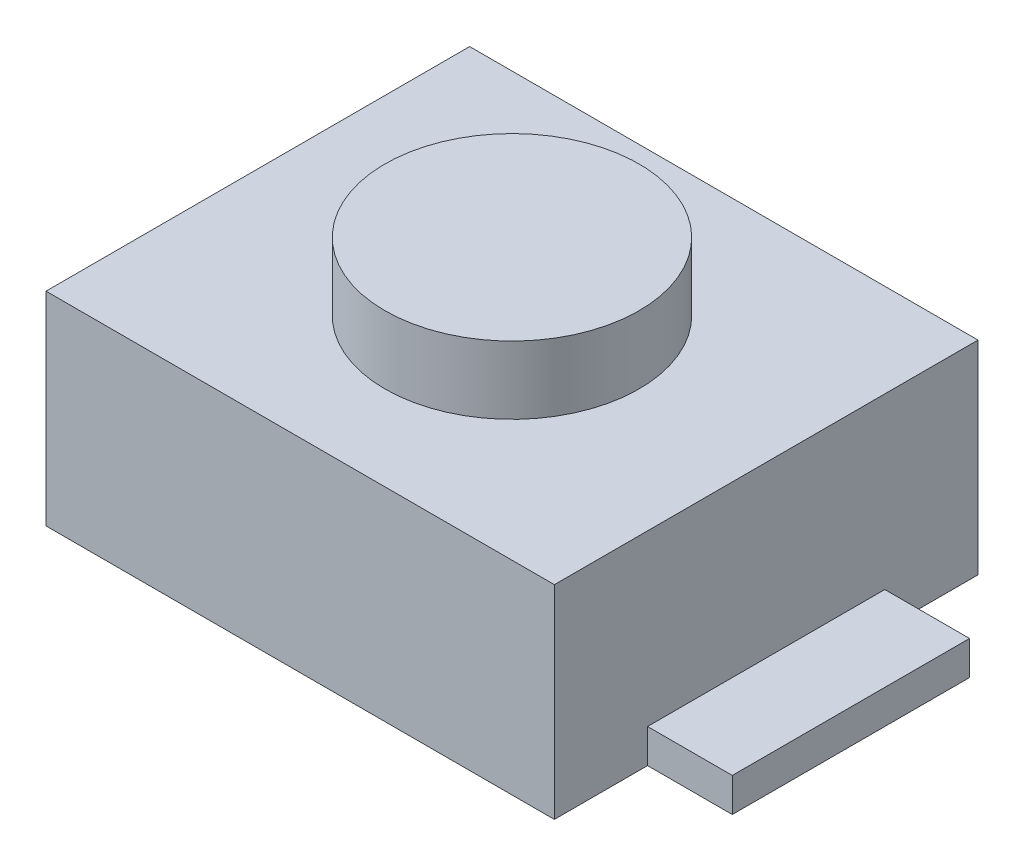
ISO-10303-21;
HEADER;
FILE_DESCRIPTION(('STEP AP214'),'2;1');
FILE_NAME('part.step','',(''),(''),'','','');
FILE_SCHEMA(('AUTOMOTIVE_DESIGN { 1 0 10303 214 1 1 1 1 }'));
ENDSEC;
DATA;
#1=APPLICATION_CONTEXT('core data for automotive mechanical design processes');
#2=APPLICATION_PROTOCOL_DEFINITION('international standard','automotive_design',2000,#1);
#3=PRODUCT_CONTEXT('',#1,'mechanical');
#4=PRODUCT('Part','Part','',(#3));
#5=PRODUCT_RELATED_PRODUCT_CATEGORY('part','',(#4));
#6=PRODUCT_DEFINITION_FORMATION('','',#4);
#7=PRODUCT_DEFINITION_CONTEXT('part definition',#1,'design');
#8=PRODUCT_DEFINITION('design','',#6,#7);
#9=PRODUCT_DEFINITION_SHAPE('','',#8);
#10=(LENGTH_UNIT() NAMED_UNIT(*) SI_UNIT(.MILLI.,.METRE.));
#11=(NAMED_UNIT(*) PLANE_ANGLE_UNIT() SI_UNIT($,.RADIAN.));
#12=(NAMED_UNIT(*) SI_UNIT($,.STERADIAN.) SOLID_ANGLE_UNIT());
#13=UNCERTAINTY_MEASURE_WITH_UNIT(LENGTH_MEASURE(1.E-05),#10,'distance_accuracy_value','');
#14=(GEOMETRIC_REPRESENTATION_CONTEXT(3) GLOBAL_UNCERTAINTY_ASSIGNED_CONTEXT((#13)) GLOBAL_UNIT_ASSIGNED_CONTEXT((#10,
#11,#12)) REPRESENTATION_CONTEXT('',''));
#15=CARTESIAN_POINT('',(0.,0.,0.));
#16=DIRECTION('',(0.,0.,1.));
#17=DIRECTION('',(1.,0.,0.));
#18=AXIS2_PLACEMENT_3D('',#15,#16,#17);
#19=CARTESIAN_POINT('',(-1.5,1.2,-1.25));
#20=DIRECTION('',(0.,0.,-1.));
#21=DIRECTION('',(-1.,0.,0.));
#22=AXIS2_PLACEMENT_3D('',#19,#20,#21);
#23=PLANE('',#22);
#24=DIRECTION('',(1.,0.,0.));
#25=VECTOR('',#24,1.);
#26=CARTESIAN_POINT('',(-1.5,0.,-1.25));
#27=LINE('',#26,#25);
#28=CARTESIAN_POINT('',(-1.5,0.,-1.25));
#29=VERTEX_POINT('',#28);
#30=CARTESIAN_POINT('',(1.5,0.,-1.25));
#31=VERTEX_POINT('',#30);
#32=EDGE_CURVE('E210',#29,#31,#27,.T.);
#33=ORIENTED_EDGE('',*,*,#32,.F.);
#34=DIRECTION('',(0.,-1.,0.));
#35=VECTOR('',#34,1.);
#36=CARTESIAN_POINT('',(-1.5,1.2,-1.25));
#37=LINE('',#36,#35);
#38=CARTESIAN_POINT('',(-1.5,1.2,-1.25));
#39=VERTEX_POINT('',#38);
#40=EDGE_CURVE('E11',#39,#29,#37,.T.);
#41=ORIENTED_EDGE('',*,*,#40,.F.);
#42=DIRECTION('',(1.,0.,0.));
#43=VECTOR('',#42,1.);
#44=CARTESIAN_POINT('',(-1.5,1.2,-1.25));
#45=LINE('',#44,#43);
#46=CARTESIAN_POINT('',(1.5,1.2,-1.25));
#47=VERTEX_POINT('',#46);
#48=EDGE_CURVE('E193',#39,#47,#45,.T.);
#49=ORIENTED_EDGE('',*,*,#48,.T.);
#50=DIRECTION('',(0.,-1.,0.));
#51=VECTOR('',#50,1.);
#52=CARTESIAN_POINT('',(1.5,1.2,-1.25));
#53=LINE('',#52,#51);
#54=EDGE_CURVE('E204',#47,#31,#53,.T.);
#55=ORIENTED_EDGE('',*,*,#54,.T.);
#56=EDGE_LOOP('',(#33,#41,#49,#55));
#57=FACE_BOUND('',#56,.T.);
#58=ADVANCED_FACE('F33',(#57),#23,.T.);
#59=CARTESIAN_POINT('',(-1.5,1.2,1.25));
#60=DIRECTION('',(-1.,0.,0.));
#61=DIRECTION('',(0.,0.,1.));
#62=AXIS2_PLACEMENT_3D('',#59,#60,#61);
#63=PLANE('',#62);
#64=DIRECTION('',(0.,1.,0.));
#65=VECTOR('',#64,1.);
#66=CARTESIAN_POINT('',(-1.5,0.2,0.7));
#67=LINE('',#66,#65);
#68=CARTESIAN_POINT('',(-1.5,0.,0.7));
#69=VERTEX_POINT('',#68);
#70=CARTESIAN_POINT('',(-1.5,0.2,0.7));
#71=VERTEX_POINT('',#70);
#72=EDGE_CURVE('E143',#69,#71,#67,.T.);
#73=ORIENTED_EDGE('',*,*,#72,.F.);
#74=DIRECTION('',(0.,0.,-1.));
#75=VECTOR('',#74,1.);
#76=CARTESIAN_POINT('',(-1.5,0.,1.25));
#77=LINE('',#76,#75);
#78=CARTESIAN_POINT('',(-1.5,0.,1.25));
#79=VERTEX_POINT('',#78);
#80=EDGE_CURVE('E189',#79,#69,#77,.T.);
#81=ORIENTED_EDGE('',*,*,#80,.F.);
#82=DIRECTION('',(0.,-1.,0.));
#83=VECTOR('',#82,1.);
#84=CARTESIAN_POINT('',(-1.5,1.2,1.25));
#85=LINE('',#84,#83);
#86=CARTESIAN_POINT('',(-1.5,1.2,1.25));
#87=VERTEX_POINT('',#86);
#88=EDGE_CURVE('E41',#87,#79,#85,.T.);
#89=ORIENTED_EDGE('',*,*,#88,.F.);
#90=DIRECTION('',(0.,0.,-1.));
#91=VECTOR('',#90,1.);
#92=CARTESIAN_POINT('',(-1.5,1.2,1.25));
#93=LINE('',#92,#91);
#94=EDGE_CURVE('E205',#87,#39,#93,.T.);
#95=ORIENTED_EDGE('',*,*,#94,.T.);
#96=ORIENTED_EDGE('',*,*,#40,.T.);
#97=CARTESIAN_POINT('',(-1.5,0.,-0.7));
#98=VERTEX_POINT('',#97);
#99=EDGE_CURVE('E54',#98,#29,#77,.T.);
#100=ORIENTED_EDGE('',*,*,#99,.F.);
#101=DIRECTION('',(0.,-1.,0.));
#102=VECTOR('',#101,1.);
#103=CARTESIAN_POINT('',(-1.5,0.,-0.7));
#104=LINE('',#103,#102);
#105=CARTESIAN_POINT('',(-1.5,0.2,-0.7));
#106=VERTEX_POINT('',#105);
#107=EDGE_CURVE('E140',#106,#98,#104,.T.);
#108=ORIENTED_EDGE('',*,*,#107,.F.);
#109=DIRECTION('',(0.,0.,-1.));
#110=VECTOR('',#109,1.);
#111=CARTESIAN_POINT('',(-1.5,0.2,-0.7));
#112=LINE('',#111,#110);
#113=EDGE_CURVE('E49',#71,#106,#112,.T.);
#114=ORIENTED_EDGE('',*,*,#113,.F.);
#115=EDGE_LOOP('',(#73,#81,#89,#95,#96,#100,#108,#114));
#116=FACE_BOUND('',#115,.T.);
#117=ADVANCED_FACE('F251',(#116),#63,.T.);
#118=CARTESIAN_POINT('',(1.5,1.2,1.25));
#119=DIRECTION('',(0.,0.,1.));
#120=DIRECTION('',(1.,0.,0.));
#121=AXIS2_PLACEMENT_3D('',#118,#119,#120);
#122=PLANE('',#121);
#123=DIRECTION('',(-1.,0.,0.));
#124=VECTOR('',#123,1.);
#125=CARTESIAN_POINT('',(1.5,0.,1.25));
#126=LINE('',#125,#124);
#127=CARTESIAN_POINT('',(1.5,0.,1.25));
#128=VERTEX_POINT('',#127);
#129=EDGE_CURVE('E197',#128,#79,#126,.T.);
#130=ORIENTED_EDGE('',*,*,#129,.F.);
#131=DIRECTION('',(0.,-1.,0.));
#132=VECTOR('',#131,1.);
#133=CARTESIAN_POINT('',(1.5,1.2,1.25));
#134=LINE('',#133,#132);
#135=CARTESIAN_POINT('',(1.5,1.2,1.25));
#136=VERTEX_POINT('',#135);
#137=EDGE_CURVE('E201',#136,#128,#134,.T.);
#138=ORIENTED_EDGE('',*,*,#137,.F.);
#139=DIRECTION('',(-1.,0.,0.));
#140=VECTOR('',#139,1.);
#141=CARTESIAN_POINT('',(1.5,1.2,1.25));
#142=LINE('',#141,#140);
#143=EDGE_CURVE('E216',#136,#87,#142,.T.);
#144=ORIENTED_EDGE('',*,*,#143,.T.);
#145=ORIENTED_EDGE('',*,*,#88,.T.);
#146=EDGE_LOOP('',(#130,#138,#144,#145));
#147=FACE_BOUND('',#146,.T.);
#148=ADVANCED_FACE('F256',(#147),#122,.T.);
#149=CARTESIAN_POINT('',(1.5,1.2,-1.25));
#150=DIRECTION('',(1.,0.,0.));
#151=DIRECTION('',(0.,0.,-1.));
#152=AXIS2_PLACEMENT_3D('',#149,#150,#151);
#153=PLANE('',#152);
#154=DIRECTION('',(0.,1.,0.));
#155=VECTOR('',#154,1.);
#156=CARTESIAN_POINT('',(1.5,0.2,-0.7));
#157=LINE('',#156,#155);
#158=CARTESIAN_POINT('',(1.5,0.,-0.7));
#159=VERTEX_POINT('',#158);
#160=CARTESIAN_POINT('',(1.5,0.2,-0.7));
#161=VERTEX_POINT('',#160);
#162=EDGE_CURVE('E157',#159,#161,#157,.T.);
#163=ORIENTED_EDGE('',*,*,#162,.F.);
#164=DIRECTION('',(0.,0.,1.));
#165=VECTOR('',#164,1.);
#166=CARTESIAN_POINT('',(1.5,0.,-1.25));
#167=LINE('',#166,#165);
#168=EDGE_CURVE('E206',#31,#159,#167,.T.);
#169=ORIENTED_EDGE('',*,*,#168,.F.);
#170=ORIENTED_EDGE('',*,*,#54,.F.);
#171=DIRECTION('',(0.,0.,1.));
#172=VECTOR('',#171,1.);
#173=CARTESIAN_POINT('',(1.5,1.2,-1.25));
#174=LINE('',#173,#172);
#175=EDGE_CURVE('E219',#47,#136,#174,.T.);
#176=ORIENTED_EDGE('',*,*,#175,.T.);
#177=ORIENTED_EDGE('',*,*,#137,.T.);
#178=CARTESIAN_POINT('',(1.5,0.,0.7));
#179=VERTEX_POINT('',#178);
#180=EDGE_CURVE('E171',#179,#128,#167,.T.);
#181=ORIENTED_EDGE('',*,*,#180,.F.);
#182=DIRECTION('',(0.,-1.,0.));
#183=VECTOR('',#182,1.);
#184=CARTESIAN_POINT('',(1.5,0.,0.7));
#185=LINE('',#184,#183);
#186=CARTESIAN_POINT('',(1.5,0.2,0.7));
#187=VERTEX_POINT('',#186);
#188=EDGE_CURVE('E147',#187,#179,#185,.T.);
#189=ORIENTED_EDGE('',*,*,#188,.F.);
#190=DIRECTION('',(0.,0.,1.));
#191=VECTOR('',#190,1.);
#192=CARTESIAN_POINT('',(1.5,0.2,0.7));
#193=LINE('',#192,#191);
#194=EDGE_CURVE('E144',#161,#187,#193,.T.);
#195=ORIENTED_EDGE('',*,*,#194,.F.);
#196=EDGE_LOOP('',(#163,#169,#170,#176,#177,#181,#189,#195));
#197=FACE_BOUND('',#196,.T.);
#198=ADVANCED_FACE('F234',(#197),#153,.T.);
#199=CARTESIAN_POINT('',(1.5,1.2,-1.25));
#200=DIRECTION('',(0.,-1.,0.));
#201=DIRECTION('',(0.,0.,-1.));
#202=AXIS2_PLACEMENT_3D('',#199,#200,#201);
#203=PLANE('',#202);
#204=CARTESIAN_POINT('',(0.,1.2,0.));
#205=DIRECTION('',(0.,1.,0.));
#206=DIRECTION('',(0.,0.,1.));
#207=AXIS2_PLACEMENT_3D('',#204,#205,#206);
#208=CIRCLE('',#207,0.75);
#209=CARTESIAN_POINT('',(0.,1.2,0.75));
#210=VERTEX_POINT('',#209);
#211=EDGE_CURVE('E270',#210,#210,#208,.T.);
#212=ORIENTED_EDGE('',*,*,#211,.F.);
#213=EDGE_LOOP('',(#212));
#214=FACE_BOUND('',#213,.T.);
#215=ORIENTED_EDGE('',*,*,#48,.F.);
#216=ORIENTED_EDGE('',*,*,#94,.F.);
#217=ORIENTED_EDGE('',*,*,#143,.F.);
#218=ORIENTED_EDGE('',*,*,#175,.F.);
#219=EDGE_LOOP('',(#215,#216,#217,#218));
#220=FACE_BOUND('',#219,.T.);
#221=ADVANCED_FACE('F249',(#214,#220),#203,.F.);
#222=CARTESIAN_POINT('',(1.5,0.,-1.25));
#223=DIRECTION('',(0.,-1.,0.));
#224=DIRECTION('',(0.,0.,-1.));
#225=AXIS2_PLACEMENT_3D('',#222,#223,#224);
#226=PLANE('',#225);
#227=ORIENTED_EDGE('',*,*,#32,.T.);
#228=ORIENTED_EDGE('',*,*,#168,.T.);
#229=DIRECTION('',(-1.,0.,0.));
#230=VECTOR('',#229,1.);
#231=CARTESIAN_POINT('',(2.,0.,-0.7));
#232=LINE('',#231,#230);
#233=CARTESIAN_POINT('',(2.,0.,-0.7));
#234=VERTEX_POINT('',#233);
#235=EDGE_CURVE('E178',#234,#159,#232,.T.);
#236=ORIENTED_EDGE('',*,*,#235,.F.);
#237=DIRECTION('',(0.,0.,-1.));
#238=VECTOR('',#237,1.);
#239=CARTESIAN_POINT('',(2.,0.,-0.7));
#240=LINE('',#239,#238);
#241=CARTESIAN_POINT('',(2.,0.,0.7));
#242=VERTEX_POINT('',#241);
#243=EDGE_CURVE('E159',#242,#234,#240,.T.);
#244=ORIENTED_EDGE('',*,*,#243,.F.);
#245=DIRECTION('',(-1.,0.,0.));
#246=VECTOR('',#245,1.);
#247=CARTESIAN_POINT('',(2.,0.,0.7));
#248=LINE('',#247,#246);
#249=EDGE_CURVE('E174',#242,#179,#248,.T.);
#250=ORIENTED_EDGE('',*,*,#249,.T.);
#251=ORIENTED_EDGE('',*,*,#180,.T.);
#252=ORIENTED_EDGE('',*,*,#129,.T.);
#253=ORIENTED_EDGE('',*,*,#80,.T.);
#254=DIRECTION('',(1.,0.,0.));
#255=VECTOR('',#254,1.);
#256=CARTESIAN_POINT('',(-2.,0.,0.7));
#257=LINE('',#256,#255);
#258=CARTESIAN_POINT('',(-2.,0.,0.7));
#259=VERTEX_POINT('',#258);
#260=EDGE_CURVE('E260',#259,#69,#257,.T.);
#261=ORIENTED_EDGE('',*,*,#260,.F.);
#262=DIRECTION('',(0.,0.,1.));
#263=VECTOR('',#262,1.);
#264=CARTESIAN_POINT('',(-2.,0.,0.7));
#265=LINE('',#264,#263);
#266=CARTESIAN_POINT('',(-2.,0.,-0.7));
#267=VERTEX_POINT('',#266);
#268=EDGE_CURVE('E136',#267,#259,#265,.T.);
#269=ORIENTED_EDGE('',*,*,#268,.F.);
#270=DIRECTION('',(1.,0.,0.));
#271=VECTOR('',#270,1.);
#272=CARTESIAN_POINT('',(-2.,0.,-0.7));
#273=LINE('',#272,#271);
#274=EDGE_CURVE('E149',#267,#98,#273,.T.);
#275=ORIENTED_EDGE('',*,*,#274,.T.);
#276=ORIENTED_EDGE('',*,*,#99,.T.);
#277=EDGE_LOOP('',(#227,#228,#236,#244,#250,#251,#252,#253,#261,#269,#275,#276));
#278=FACE_BOUND('',#277,.T.);
#279=ADVANCED_FACE('F242',(#278),#226,.T.);
#280=CARTESIAN_POINT('',(2.,0.2,0.7));
#281=DIRECTION('',(0.,-1.,0.));
#282=DIRECTION('',(0.,0.,-1.));
#283=AXIS2_PLACEMENT_3D('',#280,#281,#282);
#284=PLANE('',#283);
#285=ORIENTED_EDGE('',*,*,#194,.T.);
#286=DIRECTION('',(-1.,0.,0.));
#287=VECTOR('',#286,1.);
#288=CARTESIAN_POINT('',(2.,0.2,0.7));
#289=LINE('',#288,#287);
#290=CARTESIAN_POINT('',(2.,0.2,0.7));
#291=VERTEX_POINT('',#290);
#292=EDGE_CURVE('E177',#291,#187,#289,.T.);
#293=ORIENTED_EDGE('',*,*,#292,.F.);
#294=DIRECTION('',(0.,0.,1.));
#295=VECTOR('',#294,1.);
#296=CARTESIAN_POINT('',(2.,0.2,0.7));
#297=LINE('',#296,#295);
#298=CARTESIAN_POINT('',(2.,0.2,-0.7));
#299=VERTEX_POINT('',#298);
#300=EDGE_CURVE('E153',#299,#291,#297,.T.);
#301=ORIENTED_EDGE('',*,*,#300,.F.);
#302=DIRECTION('',(-1.,0.,0.));
#303=VECTOR('',#302,1.);
#304=CARTESIAN_POINT('',(2.,0.2,-0.7));
#305=LINE('',#304,#303);
#306=EDGE_CURVE('E162',#299,#161,#305,.T.);
#307=ORIENTED_EDGE('',*,*,#306,.T.);
#308=EDGE_LOOP('',(#285,#293,#301,#307));
#309=FACE_BOUND('',#308,.T.);
#310=ADVANCED_FACE('F231',(#309),#284,.F.);
#311=CARTESIAN_POINT('',(2.,0.,0.7));
#312=DIRECTION('',(0.,0.,-1.));
#313=DIRECTION('',(-1.,0.,0.));
#314=AXIS2_PLACEMENT_3D('',#311,#312,#313);
#315=PLANE('',#314);
#316=ORIENTED_EDGE('',*,*,#188,.T.);
#317=ORIENTED_EDGE('',*,*,#249,.F.);
#318=DIRECTION('',(0.,-1.,0.));
#319=VECTOR('',#318,1.);
#320=CARTESIAN_POINT('',(2.,0.,0.7));
#321=LINE('',#320,#319);
#322=EDGE_CURVE('E156',#291,#242,#321,.T.);
#323=ORIENTED_EDGE('',*,*,#322,.F.);
#324=ORIENTED_EDGE('',*,*,#292,.T.);
#325=EDGE_LOOP('',(#316,#317,#323,#324));
#326=FACE_BOUND('',#325,.T.);
#327=ADVANCED_FACE('F226',(#326),#315,.F.);
#328=CARTESIAN_POINT('',(2.,0.2,-0.7));
#329=DIRECTION('',(0.,0.,1.));
#330=DIRECTION('',(1.,0.,0.));
#331=AXIS2_PLACEMENT_3D('',#328,#329,#330);
#332=PLANE('',#331);
#333=ORIENTED_EDGE('',*,*,#162,.T.);
#334=ORIENTED_EDGE('',*,*,#306,.F.);
#335=DIRECTION('',(0.,1.,0.));
#336=VECTOR('',#335,1.);
#337=CARTESIAN_POINT('',(2.,0.2,-0.7));
#338=LINE('',#337,#336);
#339=EDGE_CURVE('E161',#234,#299,#338,.T.);
#340=ORIENTED_EDGE('',*,*,#339,.F.);
#341=ORIENTED_EDGE('',*,*,#235,.T.);
#342=EDGE_LOOP('',(#333,#334,#340,#341));
#343=FACE_BOUND('',#342,.T.);
#344=ADVANCED_FACE('F237',(#343),#332,.F.);
#345=CARTESIAN_POINT('',(2.,0.2,-0.7));
#346=DIRECTION('',(-1.,0.,0.));
#347=DIRECTION('',(0.,0.,1.));
#348=AXIS2_PLACEMENT_3D('',#345,#346,#347);
#349=PLANE('',#348);
#350=ORIENTED_EDGE('',*,*,#300,.T.);
#351=ORIENTED_EDGE('',*,*,#322,.T.);
#352=ORIENTED_EDGE('',*,*,#243,.T.);
#353=ORIENTED_EDGE('',*,*,#339,.T.);
#354=EDGE_LOOP('',(#350,#351,#352,#353));
#355=FACE_BOUND('',#354,.T.);
#356=ADVANCED_FACE('F317',(#355),#349,.F.);
#357=CARTESIAN_POINT('',(-2.,0.2,0.7));
#358=DIRECTION('',(0.,0.,-1.));
#359=DIRECTION('',(-1.,0.,0.));
#360=AXIS2_PLACEMENT_3D('',#357,#358,#359);
#361=PLANE('',#360);
#362=ORIENTED_EDGE('',*,*,#72,.T.);
#363=DIRECTION('',(1.,0.,0.));
#364=VECTOR('',#363,1.);
#365=CARTESIAN_POINT('',(-2.,0.2,0.7));
#366=LINE('',#365,#364);
#367=CARTESIAN_POINT('',(-2.,0.2,0.7));
#368=VERTEX_POINT('',#367);
#369=EDGE_CURVE('E124',#368,#71,#366,.T.);
#370=ORIENTED_EDGE('',*,*,#369,.F.);
#371=DIRECTION('',(0.,1.,0.));
#372=VECTOR('',#371,1.);
#373=CARTESIAN_POINT('',(-2.,0.2,0.7));
#374=LINE('',#373,#372);
#375=EDGE_CURVE('E131',#259,#368,#374,.T.);
#376=ORIENTED_EDGE('',*,*,#375,.F.);
#377=ORIENTED_EDGE('',*,*,#260,.T.);
#378=EDGE_LOOP('',(#362,#370,#376,#377));
#379=FACE_BOUND('',#378,.T.);
#380=ADVANCED_FACE('F142',(#379),#361,.F.);
#381=CARTESIAN_POINT('',(-2.,0.2,-0.7));
#382=DIRECTION('',(0.,-1.,0.));
#383=DIRECTION('',(0.,0.,-1.));
#384=AXIS2_PLACEMENT_3D('',#381,#382,#383);
#385=PLANE('',#384);
#386=ORIENTED_EDGE('',*,*,#113,.T.);
#387=DIRECTION('',(1.,0.,0.));
#388=VECTOR('',#387,1.);
#389=CARTESIAN_POINT('',(-2.,0.2,-0.7));
#390=LINE('',#389,#388);
#391=CARTESIAN_POINT('',(-2.,0.2,-0.7));
#392=VERTEX_POINT('',#391);
#393=EDGE_CURVE('E127',#392,#106,#390,.T.);
#394=ORIENTED_EDGE('',*,*,#393,.F.);
#395=DIRECTION('',(0.,0.,-1.));
#396=VECTOR('',#395,1.);
#397=CARTESIAN_POINT('',(-2.,0.2,-0.7));
#398=LINE('',#397,#396);
#399=EDGE_CURVE('E120',#368,#392,#398,.T.);
#400=ORIENTED_EDGE('',*,*,#399,.F.);
#401=ORIENTED_EDGE('',*,*,#369,.T.);
#402=EDGE_LOOP('',(#386,#394,#400,#401));
#403=FACE_BOUND('',#402,.T.);
#404=ADVANCED_FACE('F122',(#403),#385,.F.);
#405=CARTESIAN_POINT('',(-2.,0.,-0.7));
#406=DIRECTION('',(0.,0.,1.));
#407=DIRECTION('',(1.,0.,0.));
#408=AXIS2_PLACEMENT_3D('',#405,#406,#407);
#409=PLANE('',#408);
#410=ORIENTED_EDGE('',*,*,#107,.T.);
#411=ORIENTED_EDGE('',*,*,#274,.F.);
#412=DIRECTION('',(0.,-1.,0.));
#413=VECTOR('',#412,1.);
#414=CARTESIAN_POINT('',(-2.,0.,-0.7));
#415=LINE('',#414,#413);
#416=EDGE_CURVE('E130',#392,#267,#415,.T.);
#417=ORIENTED_EDGE('',*,*,#416,.F.);
#418=ORIENTED_EDGE('',*,*,#393,.T.);
#419=EDGE_LOOP('',(#410,#411,#417,#418));
#420=FACE_BOUND('',#419,.T.);
#421=ADVANCED_FACE('F288',(#420),#409,.F.);
#422=CARTESIAN_POINT('',(-2.,0.,0.7));
#423=DIRECTION('',(1.,0.,0.));
#424=DIRECTION('',(0.,0.,-1.));
#425=AXIS2_PLACEMENT_3D('',#422,#423,#424);
#426=PLANE('',#425);
#427=ORIENTED_EDGE('',*,*,#375,.T.);
#428=ORIENTED_EDGE('',*,*,#399,.T.);
#429=ORIENTED_EDGE('',*,*,#416,.T.);
#430=ORIENTED_EDGE('',*,*,#268,.T.);
#431=EDGE_LOOP('',(#427,#428,#429,#430));
#432=FACE_BOUND('',#431,.T.);
#433=ADVANCED_FACE('F134',(#432),#426,.F.);
#434=CARTESIAN_POINT('',(0.,1.2,0.));
#435=DIRECTION('',(0.,1.,0.));
#436=DIRECTION('',(0.,0.,1.));
#437=AXIS2_PLACEMENT_3D('',#434,#435,#436);
#438=CYLINDRICAL_SURFACE('',#437,0.75);
#439=ORIENTED_EDGE('',*,*,#211,.T.);
#440=EDGE_LOOP('',(#439));
#441=FACE_BOUND('',#440,.T.);
#442=CARTESIAN_POINT('',(0.,1.6,0.));
#443=DIRECTION('',(0.,1.,0.));
#444=DIRECTION('',(0.,0.,1.));
#445=AXIS2_PLACEMENT_3D('',#442,#443,#444);
#446=CIRCLE('',#445,0.75);
#447=CARTESIAN_POINT('',(0.,1.6,0.75));
#448=VERTEX_POINT('',#447);
#449=EDGE_CURVE('E273',#448,#448,#446,.T.);
#450=ORIENTED_EDGE('',*,*,#449,.F.);
#451=EDGE_LOOP('',(#450));
#452=FACE_BOUND('',#451,.T.);
#453=ADVANCED_FACE('F279',(#441,#452),#438,.T.);
#454=CARTESIAN_POINT('',(0.,1.6,0.));
#455=DIRECTION('',(0.,1.,0.));
#456=DIRECTION('',(0.,0.,1.));
#457=AXIS2_PLACEMENT_3D('',#454,#455,#456);
#458=PLANE('',#457);
#459=ORIENTED_EDGE('',*,*,#449,.T.);
#460=EDGE_LOOP('',(#459));
#461=FACE_BOUND('',#460,.T.);
#462=ADVANCED_FACE('F277',(#461),#458,.T.);
#463=CLOSED_SHELL('',(#58,#117,#148,#198,#221,#279,#310,#327,#344,#356,#380,#404,#421,#433,#453,#462));
#464=MANIFOLD_SOLID_BREP('B2',#463);
#465=ADVANCED_BREP_SHAPE_REPRESENTATION('',(#18,#464),#14);
#466=SHAPE_DEFINITION_REPRESENTATION(#9,#465);
ENDSEC;
END-ISO-10303-21;
